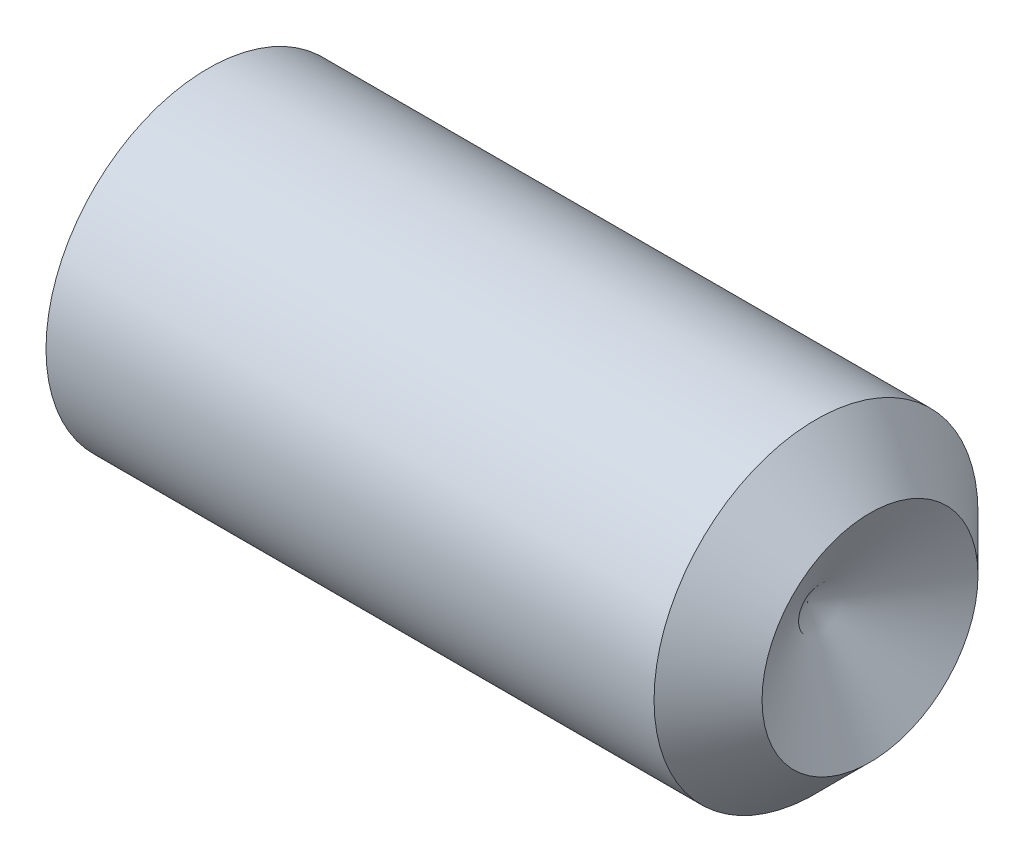
ISO-10303-21;
HEADER;
FILE_DESCRIPTION(('STEP AP214'),'2;1');
FILE_NAME('part.step','',(''),(''),'','','');
FILE_SCHEMA(('AUTOMOTIVE_DESIGN { 1 0 10303 214 1 1 1 1 }'));
ENDSEC;
DATA;
#1=APPLICATION_CONTEXT('core data for automotive mechanical design processes');
#2=APPLICATION_PROTOCOL_DEFINITION('international standard','automotive_design',2000,#1);
#3=PRODUCT_CONTEXT('',#1,'mechanical');
#4=PRODUCT('Part','Part','',(#3));
#5=PRODUCT_RELATED_PRODUCT_CATEGORY('part','',(#4));
#6=PRODUCT_DEFINITION_FORMATION('','',#4);
#7=PRODUCT_DEFINITION_CONTEXT('part definition',#1,'design');
#8=PRODUCT_DEFINITION('design','',#6,#7);
#9=PRODUCT_DEFINITION_SHAPE('','',#8);
#10=(LENGTH_UNIT() NAMED_UNIT(*) SI_UNIT(.MILLI.,.METRE.));
#11=(NAMED_UNIT(*) PLANE_ANGLE_UNIT() SI_UNIT($,.RADIAN.));
#12=(NAMED_UNIT(*) SI_UNIT($,.STERADIAN.) SOLID_ANGLE_UNIT());
#13=UNCERTAINTY_MEASURE_WITH_UNIT(LENGTH_MEASURE(1.E-05),#10,'distance_accuracy_value','');
#14=(GEOMETRIC_REPRESENTATION_CONTEXT(3) GLOBAL_UNCERTAINTY_ASSIGNED_CONTEXT((#13)) GLOBAL_UNIT_ASSIGNED_CONTEXT((#10,
#11,#12)) REPRESENTATION_CONTEXT('',''));
#15=CARTESIAN_POINT('',(0.,0.,0.));
#16=DIRECTION('',(0.,0.,1.));
#17=DIRECTION('',(1.,0.,0.));
#18=AXIS2_PLACEMENT_3D('',#15,#16,#17);
#19=CARTESIAN_POINT('',(0.,0.,0.));
#20=DIRECTION('',(-1.,0.,0.));
#21=DIRECTION('',(0.,0.,1.));
#22=AXIS2_PLACEMENT_3D('',#19,#20,#21);
#23=PLANE('',#22);
#24=CARTESIAN_POINT('',(0.,0.,0.));
#25=DIRECTION('',(-1.,0.,0.));
#26=DIRECTION('',(0.,0.,1.));
#27=AXIS2_PLACEMENT_3D('',#24,#25,#26);
#28=CIRCLE('',#27,10.352);
#29=CARTESIAN_POINT('',(0.,0.,10.352));
#30=VERTEX_POINT('',#29);
#31=EDGE_CURVE('E11',#30,#30,#28,.T.);
#32=ORIENTED_EDGE('',*,*,#31,.T.);
#33=EDGE_LOOP('',(#32));
#34=FACE_BOUND('',#33,.T.);
#35=DIRECTION('',(0.,0.,-1.));
#36=VECTOR('',#35,1.);
#37=CARTESIAN_POINT('',(0.,6.,3.46410161513775));
#38=LINE('',#37,#36);
#39=CARTESIAN_POINT('',(0.,6.,3.46410161513775));
#40=VERTEX_POINT('',#39);
#41=CARTESIAN_POINT('',(0.,6.,-3.46410161513776));
#42=VERTEX_POINT('',#41);
#43=EDGE_CURVE('E95',#40,#42,#38,.T.);
#44=ORIENTED_EDGE('',*,*,#43,.F.);
#45=DIRECTION('',(0.,-0.866025403784439,0.5));
#46=VECTOR('',#45,1.);
#47=CARTESIAN_POINT('',(0.,6.,3.46410161513775));
#48=LINE('',#47,#46);
#49=CARTESIAN_POINT('',(0.,0.,6.9282032302755));
#50=VERTEX_POINT('',#49);
#51=EDGE_CURVE('E48',#40,#50,#48,.T.);
#52=ORIENTED_EDGE('',*,*,#51,.T.);
#53=DIRECTION('',(0.,0.866025403784439,0.5));
#54=VECTOR('',#53,1.);
#55=CARTESIAN_POINT('',(0.,-5.99999999999999,3.46410161513775));
#56=LINE('',#55,#54);
#57=CARTESIAN_POINT('',(0.,-5.99999999999999,3.46410161513775));
#58=VERTEX_POINT('',#57);
#59=EDGE_CURVE('E101',#58,#50,#56,.T.);
#60=ORIENTED_EDGE('',*,*,#59,.F.);
#61=DIRECTION('',(0.,0.,-1.));
#62=VECTOR('',#61,1.);
#63=CARTESIAN_POINT('',(0.,-5.99999999999999,3.46410161513775));
#64=LINE('',#63,#62);
#65=CARTESIAN_POINT('',(0.,-5.99999999999999,-3.46410161513776));
#66=VERTEX_POINT('',#65);
#67=EDGE_CURVE('E121',#58,#66,#64,.T.);
#68=ORIENTED_EDGE('',*,*,#67,.T.);
#69=DIRECTION('',(0.,0.866025403784438,-0.5));
#70=VECTOR('',#69,1.);
#71=CARTESIAN_POINT('',(0.,-5.99999999999999,-3.46410161513776));
#72=LINE('',#71,#70);
#73=CARTESIAN_POINT('',(0.,0.,-6.92820323027551));
#74=VERTEX_POINT('',#73);
#75=EDGE_CURVE('E124',#66,#74,#72,.T.);
#76=ORIENTED_EDGE('',*,*,#75,.T.);
#77=DIRECTION('',(0.,-0.866025403784439,-0.5));
#78=VECTOR('',#77,1.);
#79=CARTESIAN_POINT('',(0.,6.,-3.46410161513776));
#80=LINE('',#79,#78);
#81=EDGE_CURVE('E127',#42,#74,#80,.T.);
#82=ORIENTED_EDGE('',*,*,#81,.F.);
#83=EDGE_LOOP('',(#44,#52,#60,#68,#76,#82));
#84=FACE_BOUND('',#83,.T.);
#85=ADVANCED_FACE('F34',(#34,#84),#23,.T.);
#86=CARTESIAN_POINT('',(0.,0.,0.));
#87=DIRECTION('',(1.,0.,0.));
#88=DIRECTION('',(0.,0.,-1.));
#89=AXIS2_PLACEMENT_3D('',#86,#87,#88);
#90=CONICAL_SURFACE('',#89,10.352,1.04719755119662);
#91=CARTESIAN_POINT('',(0.951473243624452,0.,0.));
#92=DIRECTION('',(-1.,0.,0.));
#93=DIRECTION('',(0.,0.,1.));
#94=AXIS2_PLACEMENT_3D('',#91,#92,#93);
#95=CIRCLE('',#94,12.);
#96=CARTESIAN_POINT('',(0.951473243624452,0.,12.));
#97=VERTEX_POINT('',#96);
#98=EDGE_CURVE('E41',#97,#97,#95,.T.);
#99=ORIENTED_EDGE('',*,*,#98,.T.);
#100=EDGE_LOOP('',(#99));
#101=FACE_BOUND('',#100,.T.);
#102=ORIENTED_EDGE('',*,*,#31,.F.);
#103=EDGE_LOOP('',(#102));
#104=FACE_BOUND('',#103,.T.);
#105=ADVANCED_FACE('F147',(#101,#104),#90,.T.);
#106=CARTESIAN_POINT('',(-12.7,0.,0.));
#107=DIRECTION('',(-1.,0.,0.));
#108=DIRECTION('',(0.,0.,1.));
#109=AXIS2_PLACEMENT_3D('',#106,#107,#108);
#110=CYLINDRICAL_SURFACE('',#109,12.);
#111=CARTESIAN_POINT('',(46.,0.,0.));
#112=DIRECTION('',(-1.,0.,0.));
#113=DIRECTION('',(0.,0.,1.));
#114=AXIS2_PLACEMENT_3D('',#111,#112,#113);
#115=CIRCLE('',#114,12.);
#116=CARTESIAN_POINT('',(46.,0.,12.));
#117=VERTEX_POINT('',#116);
#118=EDGE_CURVE('E142',#117,#117,#115,.T.);
#119=ORIENTED_EDGE('',*,*,#118,.T.);
#120=EDGE_LOOP('',(#119));
#121=FACE_BOUND('',#120,.T.);
#122=ORIENTED_EDGE('',*,*,#98,.F.);
#123=EDGE_LOOP('',(#122));
#124=FACE_BOUND('',#123,.T.);
#125=ADVANCED_FACE('F150',(#121,#124),#110,.T.);
#126=CARTESIAN_POINT('',(46.,0.,0.));
#127=DIRECTION('',(-1.,0.,0.));
#128=DIRECTION('',(0.,0.,1.));
#129=AXIS2_PLACEMENT_3D('',#126,#127,#128);
#130=CONICAL_SURFACE('',#129,12.,0.785398163397447);
#131=CARTESIAN_POINT('',(50.,0.,0.));
#132=DIRECTION('',(-1.,0.,0.));
#133=DIRECTION('',(0.,0.,1.));
#134=AXIS2_PLACEMENT_3D('',#131,#132,#133);
#135=CIRCLE('',#134,8.);
#136=CARTESIAN_POINT('',(50.,0.,8.));
#137=VERTEX_POINT('',#136);
#138=EDGE_CURVE('E102',#137,#137,#135,.T.);
#139=ORIENTED_EDGE('',*,*,#138,.T.);
#140=EDGE_LOOP('',(#139));
#141=FACE_BOUND('',#140,.T.);
#142=ORIENTED_EDGE('',*,*,#118,.F.);
#143=EDGE_LOOP('',(#142));
#144=FACE_BOUND('',#143,.T.);
#145=ADVANCED_FACE('F152',(#141,#144),#130,.T.);
#146=CARTESIAN_POINT('',(45.381197846483,0.,0.));
#147=DIRECTION('',(1.,0.,0.));
#148=DIRECTION('',(0.,0.,-1.));
#149=AXIS2_PLACEMENT_3D('',#146,#147,#148);
#150=CONICAL_SURFACE('',#149,0.,1.0471975511966);
#151=ORIENTED_EDGE('',*,*,#138,.F.);
#152=EDGE_LOOP('',(#151));
#153=FACE_BOUND('',#152,.T.);
#154=CARTESIAN_POINT('',(45.381197846483,0.,0.));
#155=VERTEX_POINT('',#154);
#156=VERTEX_LOOP('',#155);
#157=FACE_BOUND('',#156,.T.);
#158=ADVANCED_FACE('F159',(#153,#157),#150,.F.);
#159=CARTESIAN_POINT('',(15.,6.,3.46410161513775));
#160=DIRECTION('',(0.,-0.5,-0.866025403784439));
#161=DIRECTION('',(0.,0.866025403784439,-0.5));
#162=AXIS2_PLACEMENT_3D('',#159,#160,#161);
#163=PLANE('',#162);
#164=ORIENTED_EDGE('',*,*,#51,.F.);
#165=DIRECTION('',(-1.,0.,0.));
#166=VECTOR('',#165,1.);
#167=CARTESIAN_POINT('',(15.,6.,3.46410161513775));
#168=LINE('',#167,#166);
#169=CARTESIAN_POINT('',(15.,6.,3.46410161513775));
#170=VERTEX_POINT('',#169);
#171=EDGE_CURVE('E89',#170,#40,#168,.T.);
#172=ORIENTED_EDGE('',*,*,#171,.F.);
#173=DIRECTION('',(0.,-0.866025403784439,0.5));
#174=VECTOR('',#173,1.);
#175=CARTESIAN_POINT('',(15.,6.,3.46410161513775));
#176=LINE('',#175,#174);
#177=CARTESIAN_POINT('',(15.,0.,6.9282032302755));
#178=VERTEX_POINT('',#177);
#179=EDGE_CURVE('E84',#170,#178,#176,.T.);
#180=ORIENTED_EDGE('',*,*,#179,.T.);
#181=DIRECTION('',(-1.,0.,0.));
#182=VECTOR('',#181,1.);
#183=CARTESIAN_POINT('',(15.,0.,6.9282032302755));
#184=LINE('',#183,#182);
#185=EDGE_CURVE('E87',#178,#50,#184,.T.);
#186=ORIENTED_EDGE('',*,*,#185,.T.);
#187=EDGE_LOOP('',(#164,#172,#180,#186));
#188=FACE_BOUND('',#187,.T.);
#189=ADVANCED_FACE('F86',(#188),#163,.T.);
#190=CARTESIAN_POINT('',(15.,-5.99999999999999,3.46410161513775));
#191=DIRECTION('',(0.,-0.5,0.866025403784439));
#192=DIRECTION('',(0.,-0.866025403784439,-0.5));
#193=AXIS2_PLACEMENT_3D('',#190,#191,#192);
#194=PLANE('',#193);
#195=ORIENTED_EDGE('',*,*,#59,.T.);
#196=ORIENTED_EDGE('',*,*,#185,.F.);
#197=DIRECTION('',(0.,0.866025403784439,0.5));
#198=VECTOR('',#197,1.);
#199=CARTESIAN_POINT('',(15.,-5.99999999999999,3.46410161513775));
#200=LINE('',#199,#198);
#201=CARTESIAN_POINT('',(15.,-5.99999999999999,3.46410161513775));
#202=VERTEX_POINT('',#201);
#203=EDGE_CURVE('E94',#202,#178,#200,.T.);
#204=ORIENTED_EDGE('',*,*,#203,.F.);
#205=DIRECTION('',(-1.,0.,0.));
#206=VECTOR('',#205,1.);
#207=CARTESIAN_POINT('',(15.,-5.99999999999999,3.46410161513775));
#208=LINE('',#207,#206);
#209=EDGE_CURVE('E103',#202,#58,#208,.T.);
#210=ORIENTED_EDGE('',*,*,#209,.T.);
#211=EDGE_LOOP('',(#195,#196,#204,#210));
#212=FACE_BOUND('',#211,.T.);
#213=ADVANCED_FACE('F99',(#212),#194,.F.);
#214=CARTESIAN_POINT('',(15.,-5.99999999999999,3.46410161513775));
#215=DIRECTION('',(0.,1.,0.));
#216=DIRECTION('',(0.,0.,1.));
#217=AXIS2_PLACEMENT_3D('',#214,#215,#216);
#218=PLANE('',#217);
#219=ORIENTED_EDGE('',*,*,#67,.F.);
#220=ORIENTED_EDGE('',*,*,#209,.F.);
#221=DIRECTION('',(0.,0.,-1.));
#222=VECTOR('',#221,1.);
#223=CARTESIAN_POINT('',(15.,-5.99999999999999,3.46410161513775));
#224=LINE('',#223,#222);
#225=CARTESIAN_POINT('',(15.,-5.99999999999999,-3.46410161513776));
#226=VERTEX_POINT('',#225);
#227=EDGE_CURVE('E108',#202,#226,#224,.T.);
#228=ORIENTED_EDGE('',*,*,#227,.T.);
#229=DIRECTION('',(-1.,0.,0.));
#230=VECTOR('',#229,1.);
#231=CARTESIAN_POINT('',(15.,-5.99999999999999,-3.46410161513776));
#232=LINE('',#231,#230);
#233=EDGE_CURVE('E137',#226,#66,#232,.T.);
#234=ORIENTED_EDGE('',*,*,#233,.T.);
#235=EDGE_LOOP('',(#219,#220,#228,#234));
#236=FACE_BOUND('',#235,.T.);
#237=ADVANCED_FACE('F182',(#236),#218,.T.);
#238=CARTESIAN_POINT('',(15.,-5.99999999999999,-3.46410161513776));
#239=DIRECTION('',(0.,0.5,0.866025403784438));
#240=DIRECTION('',(0.,-0.866025403784439,0.5));
#241=AXIS2_PLACEMENT_3D('',#238,#239,#240);
#242=PLANE('',#241);
#243=ORIENTED_EDGE('',*,*,#75,.F.);
#244=ORIENTED_EDGE('',*,*,#233,.F.);
#245=DIRECTION('',(0.,0.866025403784438,-0.5));
#246=VECTOR('',#245,1.);
#247=CARTESIAN_POINT('',(15.,-5.99999999999999,-3.46410161513776));
#248=LINE('',#247,#246);
#249=CARTESIAN_POINT('',(15.,0.,-6.92820323027551));
#250=VERTEX_POINT('',#249);
#251=EDGE_CURVE('E110',#226,#250,#248,.T.);
#252=ORIENTED_EDGE('',*,*,#251,.T.);
#253=DIRECTION('',(-1.,0.,0.));
#254=VECTOR('',#253,1.);
#255=CARTESIAN_POINT('',(15.,0.,-6.92820323027551));
#256=LINE('',#255,#254);
#257=EDGE_CURVE('E135',#250,#74,#256,.T.);
#258=ORIENTED_EDGE('',*,*,#257,.T.);
#259=EDGE_LOOP('',(#243,#244,#252,#258));
#260=FACE_BOUND('',#259,.T.);
#261=ADVANCED_FACE('F178',(#260),#242,.T.);
#262=CARTESIAN_POINT('',(15.,6.,-3.46410161513776));
#263=DIRECTION('',(0.,0.5,-0.866025403784438));
#264=DIRECTION('',(0.,0.866025403784439,0.5));
#265=AXIS2_PLACEMENT_3D('',#262,#263,#264);
#266=PLANE('',#265);
#267=ORIENTED_EDGE('',*,*,#81,.T.);
#268=ORIENTED_EDGE('',*,*,#257,.F.);
#269=DIRECTION('',(0.,-0.866025403784439,-0.5));
#270=VECTOR('',#269,1.);
#271=CARTESIAN_POINT('',(15.,6.,-3.46410161513776));
#272=LINE('',#271,#270);
#273=CARTESIAN_POINT('',(15.,6.,-3.46410161513776));
#274=VERTEX_POINT('',#273);
#275=EDGE_CURVE('E114',#274,#250,#272,.T.);
#276=ORIENTED_EDGE('',*,*,#275,.F.);
#277=DIRECTION('',(-1.,0.,0.));
#278=VECTOR('',#277,1.);
#279=CARTESIAN_POINT('',(15.,6.,-3.46410161513776));
#280=LINE('',#279,#278);
#281=EDGE_CURVE('E133',#274,#42,#280,.T.);
#282=ORIENTED_EDGE('',*,*,#281,.T.);
#283=EDGE_LOOP('',(#267,#268,#276,#282));
#284=FACE_BOUND('',#283,.T.);
#285=ADVANCED_FACE('F175',(#284),#266,.F.);
#286=CARTESIAN_POINT('',(15.,6.,3.46410161513775));
#287=DIRECTION('',(0.,1.,0.));
#288=DIRECTION('',(0.,0.,1.));
#289=AXIS2_PLACEMENT_3D('',#286,#287,#288);
#290=PLANE('',#289);
#291=ORIENTED_EDGE('',*,*,#43,.T.);
#292=ORIENTED_EDGE('',*,*,#281,.F.);
#293=DIRECTION('',(0.,0.,-1.));
#294=VECTOR('',#293,1.);
#295=CARTESIAN_POINT('',(15.,6.,3.46410161513775));
#296=LINE('',#295,#294);
#297=EDGE_CURVE('E117',#170,#274,#296,.T.);
#298=ORIENTED_EDGE('',*,*,#297,.F.);
#299=ORIENTED_EDGE('',*,*,#171,.T.);
#300=EDGE_LOOP('',(#291,#292,#298,#299));
#301=FACE_BOUND('',#300,.T.);
#302=ADVANCED_FACE('F171',(#301),#290,.F.);
#303=CARTESIAN_POINT('',(15.,6.,3.46410161513775));
#304=DIRECTION('',(1.,0.,0.));
#305=DIRECTION('',(0.,0.,-1.));
#306=AXIS2_PLACEMENT_3D('',#303,#304,#305);
#307=PLANE('',#306);
#308=ORIENTED_EDGE('',*,*,#179,.F.);
#309=ORIENTED_EDGE('',*,*,#297,.T.);
#310=ORIENTED_EDGE('',*,*,#275,.T.);
#311=ORIENTED_EDGE('',*,*,#251,.F.);
#312=ORIENTED_EDGE('',*,*,#227,.F.);
#313=ORIENTED_EDGE('',*,*,#203,.T.);
#314=EDGE_LOOP('',(#308,#309,#310,#311,#312,#313));
#315=FACE_BOUND('',#314,.T.);
#316=ADVANCED_FACE('F106',(#315),#307,.F.);
#317=CLOSED_SHELL('',(#85,#105,#125,#145,#158,#189,#213,#237,#261,#285,#302,#316));
#318=MANIFOLD_SOLID_BREP('B2',#317);
#319=ADVANCED_BREP_SHAPE_REPRESENTATION('',(#18,#318),#14);
#320=SHAPE_DEFINITION_REPRESENTATION(#9,#319);
ENDSEC;
END-ISO-10303-21;
